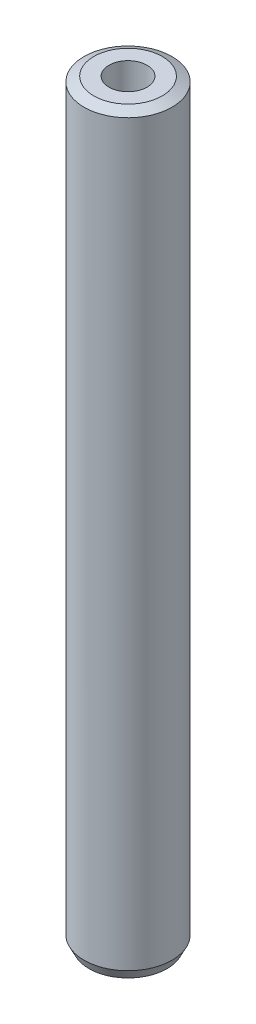
ISO-10303-21;
HEADER;
FILE_DESCRIPTION(('STEP AP214'),'2;1');
FILE_NAME('part.step','',(''),(''),'','','');
FILE_SCHEMA(('AUTOMOTIVE_DESIGN { 1 0 10303 214 1 1 1 1 }'));
ENDSEC;
DATA;
#1=APPLICATION_CONTEXT('core data for automotive mechanical design processes');
#2=APPLICATION_PROTOCOL_DEFINITION('international standard','automotive_design',2000,#1);
#3=PRODUCT_CONTEXT('',#1,'mechanical');
#4=PRODUCT('Part','Part','',(#3));
#5=PRODUCT_RELATED_PRODUCT_CATEGORY('part','',(#4));
#6=PRODUCT_DEFINITION_FORMATION('','',#4);
#7=PRODUCT_DEFINITION_CONTEXT('part definition',#1,'design');
#8=PRODUCT_DEFINITION('design','',#6,#7);
#9=PRODUCT_DEFINITION_SHAPE('','',#8);
#10=(LENGTH_UNIT() NAMED_UNIT(*) SI_UNIT(.MILLI.,.METRE.));
#11=(NAMED_UNIT(*) PLANE_ANGLE_UNIT() SI_UNIT($,.RADIAN.));
#12=(NAMED_UNIT(*) SI_UNIT($,.STERADIAN.) SOLID_ANGLE_UNIT());
#13=UNCERTAINTY_MEASURE_WITH_UNIT(LENGTH_MEASURE(1.E-05),#10,'distance_accuracy_value','');
#14=(GEOMETRIC_REPRESENTATION_CONTEXT(3) GLOBAL_UNCERTAINTY_ASSIGNED_CONTEXT((#13)) GLOBAL_UNIT_ASSIGNED_CONTEXT((#10,
#11,#12)) REPRESENTATION_CONTEXT('',''));
#15=CARTESIAN_POINT('',(0.,0.,0.));
#16=DIRECTION('',(0.,0.,1.));
#17=DIRECTION('',(1.,0.,0.));
#18=AXIS2_PLACEMENT_3D('',#15,#16,#17);
#19=CARTESIAN_POINT('',(0.,85.6602626911975,0.));
#20=DIRECTION('',(0.,-1.,0.));
#21=DIRECTION('',(0.,0.,-1.));
#22=AXIS2_PLACEMENT_3D('',#19,#20,#21);
#23=CYLINDRICAL_SURFACE('',#22,5.);
#24=CARTESIAN_POINT('',(0.,85.1010180606395,0.));
#25=DIRECTION('',(0.,1.,0.));
#26=DIRECTION('',(0.,0.,1.));
#27=AXIS2_PLACEMENT_3D('',#24,#25,#26);
#28=CIRCLE('',#27,5.);
#29=CARTESIAN_POINT('',(0.,85.1010180606395,-5.00000000000001));
#30=VERTEX_POINT('',#29);
#31=EDGE_CURVE('E50',#30,#30,#28,.F.);
#32=ORIENTED_EDGE('',*,*,#31,.T.);
#33=EDGE_LOOP('',(#32));
#34=FACE_BOUND('',#33,.T.);
#35=CARTESIAN_POINT('',(0.,1.11116017954196,0.));
#36=DIRECTION('',(0.,1.,0.));
#37=DIRECTION('',(0.,0.,1.));
#38=AXIS2_PLACEMENT_3D('',#35,#36,#37);
#39=CIRCLE('',#38,5.);
#40=CARTESIAN_POINT('',(0.,1.11116017954196,5.));
#41=VERTEX_POINT('',#40);
#42=EDGE_CURVE('E51',#41,#41,#39,.T.);
#43=ORIENTED_EDGE('',*,*,#42,.T.);
#44=EDGE_LOOP('',(#43));
#45=FACE_BOUND('',#44,.T.);
#46=ADVANCED_FACE('F39',(#34,#45),#23,.T.);
#47=CARTESIAN_POINT('',(0.,85.6602626911975,0.));
#48=DIRECTION('',(0.,1.,0.));
#49=DIRECTION('',(0.,0.,1.));
#50=AXIS2_PLACEMENT_3D('',#47,#48,#49);
#51=PLANE('',#50);
#52=CARTESIAN_POINT('',(0.,85.6602626911975,0.));
#53=DIRECTION('',(0.,1.,0.));
#54=DIRECTION('',(0.,0.,1.));
#55=AXIS2_PLACEMENT_3D('',#52,#53,#54);
#56=CIRCLE('',#55,3.88883982045803);
#57=CARTESIAN_POINT('',(0.,85.6602626911975,-3.88883982045804));
#58=VERTEX_POINT('',#57);
#59=EDGE_CURVE('E54',#58,#58,#56,.T.);
#60=ORIENTED_EDGE('',*,*,#59,.T.);
#61=EDGE_LOOP('',(#60));
#62=FACE_BOUND('',#61,.T.);
#63=CARTESIAN_POINT('',(0.,85.6602626911975,0.));
#64=DIRECTION('',(0.,1.,0.));
#65=DIRECTION('',(0.,0.,1.));
#66=AXIS2_PLACEMENT_3D('',#63,#64,#65);
#67=CIRCLE('',#66,2.16603742396872);
#68=CARTESIAN_POINT('',(0.,85.6602626911975,2.16603742396872));
#69=VERTEX_POINT('',#68);
#70=EDGE_CURVE('E58',#69,#69,#67,.T.);
#71=ORIENTED_EDGE('',*,*,#70,.F.);
#72=EDGE_LOOP('',(#71));
#73=FACE_BOUND('',#72,.T.);
#74=ADVANCED_FACE('F69',(#62,#73),#51,.T.);
#75=CARTESIAN_POINT('',(0.,0.,0.));
#76=DIRECTION('',(0.,1.,0.));
#77=DIRECTION('',(0.,0.,1.));
#78=AXIS2_PLACEMENT_3D('',#75,#76,#77);
#79=PLANE('',#78);
#80=CARTESIAN_POINT('',(0.,0.,0.));
#81=DIRECTION('',(0.,1.,0.));
#82=DIRECTION('',(0.,0.,1.));
#83=AXIS2_PLACEMENT_3D('',#80,#81,#82);
#84=CIRCLE('',#83,4.44075536944196);
#85=CARTESIAN_POINT('',(0.,0.,4.44075536944196));
#86=VERTEX_POINT('',#85);
#87=EDGE_CURVE('E10',#86,#86,#84,.F.);
#88=ORIENTED_EDGE('',*,*,#87,.T.);
#89=EDGE_LOOP('',(#88));
#90=FACE_BOUND('',#89,.T.);
#91=CARTESIAN_POINT('',(0.,0.,0.));
#92=DIRECTION('',(0.,1.,0.));
#93=DIRECTION('',(0.,0.,1.));
#94=AXIS2_PLACEMENT_3D('',#91,#92,#93);
#95=CIRCLE('',#94,2.16603742396872);
#96=CARTESIAN_POINT('',(0.,0.,2.16603742396872));
#97=VERTEX_POINT('',#96);
#98=EDGE_CURVE('E63',#97,#97,#95,.T.);
#99=ORIENTED_EDGE('',*,*,#98,.T.);
#100=EDGE_LOOP('',(#99));
#101=FACE_BOUND('',#100,.T.);
#102=ADVANCED_FACE('F75',(#90,#101),#79,.F.);
#103=CARTESIAN_POINT('',(0.,85.6602626911975,0.));
#104=DIRECTION('',(0.,-1.,0.));
#105=DIRECTION('',(0.,0.,-1.));
#106=AXIS2_PLACEMENT_3D('',#103,#104,#105);
#107=CYLINDRICAL_SURFACE('',#106,2.16603742396872);
#108=ORIENTED_EDGE('',*,*,#70,.T.);
#109=EDGE_LOOP('',(#108));
#110=FACE_BOUND('',#109,.T.);
#111=ORIENTED_EDGE('',*,*,#98,.F.);
#112=EDGE_LOOP('',(#111));
#113=FACE_BOUND('',#112,.T.);
#114=ADVANCED_FACE('F70',(#110,#113),#107,.F.);
#115=CARTESIAN_POINT('',(0.,85.6602626911975,0.));
#116=DIRECTION('',(0.,-1.,0.));
#117=DIRECTION('',(0.,0.,-1.));
#118=AXIS2_PLACEMENT_3D('',#115,#116,#117);
#119=CONICAL_SURFACE('',#118,3.88883982045803,1.10451384690646);
#120=CARTESIAN_POINT('',(0.,85.1010180606395,-5.00000000000001));
#121=CARTESIAN_POINT('',(0.,85.1068435255411,-4.98842541479645));
#122=CARTESIAN_POINT('',(0.,85.1126689904428,-4.97685082959289));
#123=CARTESIAN_POINT('',(0.,85.1243199202461,-4.95370165918577));
#124=CARTESIAN_POINT('',(0.,85.1301453851477,-4.9421270739822));
#125=CARTESIAN_POINT('',(0.,85.141796314951,-4.91897790357508));
#126=CARTESIAN_POINT('',(0.,85.1476217798527,-4.90740331837152));
#127=CARTESIAN_POINT('',(0.,85.159272709656,-4.88425414796439));
#128=CARTESIAN_POINT('',(0.,85.1650981745576,-4.87267956276083));
#129=CARTESIAN_POINT('',(0.,85.1767491043609,-4.84953039235371));
#130=CARTESIAN_POINT('',(0.,85.1825745692625,-4.83795580715014));
#131=CARTESIAN_POINT('',(0.,85.1942254990658,-4.81480663674302));
#132=CARTESIAN_POINT('',(0.,85.2000509639675,-4.80323205153946));
#133=CARTESIAN_POINT('',(0.,85.2117018937708,-4.78008288113233));
#134=CARTESIAN_POINT('',(0.,85.2175273586724,-4.76850829592877));
#135=CARTESIAN_POINT('',(0.,85.2291782884757,-4.74535912552165));
#136=CARTESIAN_POINT('',(0.,85.2350037533774,-4.73378454031808));
#137=CARTESIAN_POINT('',(0.,85.2466546831806,-4.71063536991096));
#138=CARTESIAN_POINT('',(0.,85.2524801480823,-4.6990607847074));
#139=CARTESIAN_POINT('',(0.,85.2641310778856,-4.67591161430027));
#140=CARTESIAN_POINT('',(0.,85.2699565427872,-4.66433702909671));
#141=CARTESIAN_POINT('',(0.,85.2816074725905,-4.64118785868959));
#142=CARTESIAN_POINT('',(0.,85.2874329374922,-4.62961327348602));
#143=CARTESIAN_POINT('',(0.,85.2990838672955,-4.6064641030789));
#144=CARTESIAN_POINT('',(0.,85.3049093321971,-4.59488951787534));
#145=CARTESIAN_POINT('',(0.,85.3165602620004,-4.57174034746821));
#146=CARTESIAN_POINT('',(0.,85.322385726902,-4.56016576226465));
#147=CARTESIAN_POINT('',(0.,85.3340366567053,-4.53701659185753));
#148=CARTESIAN_POINT('',(0.,85.339862121607,-4.52544200665396));
#149=CARTESIAN_POINT('',(0.,85.3515130514103,-4.50229283624684));
#150=CARTESIAN_POINT('',(0.,85.3573385163119,-4.49071825104328));
#151=CARTESIAN_POINT('',(0.,85.3689894461152,-4.46756908063615));
#152=CARTESIAN_POINT('',(0.,85.3748149110169,-4.45599449543259));
#153=CARTESIAN_POINT('',(0.,85.3864658408202,-4.43284532502546));
#154=CARTESIAN_POINT('',(0.,85.3922913057218,-4.4212707398219));
#155=CARTESIAN_POINT('',(0.,85.4039422355251,-4.39812156941478));
#156=CARTESIAN_POINT('',(0.,85.4097677004267,-4.38654698421122));
#157=CARTESIAN_POINT('',(0.,85.42141863023,-4.36339781380409));
#158=CARTESIAN_POINT('',(0.,85.4272440951317,-4.35182322860053));
#159=CARTESIAN_POINT('',(0.,85.438895024935,-4.32867405819341));
#160=CARTESIAN_POINT('',(0.,85.4447204898366,-4.31709947298984));
#161=CARTESIAN_POINT('',(0.,85.4563714196399,-4.29395030258272));
#162=CARTESIAN_POINT('',(0.,85.4621968845416,-4.28237571737916));
#163=CARTESIAN_POINT('',(0.,85.4738478143449,-4.25922654697203));
#164=CARTESIAN_POINT('',(0.,85.4796732792465,-4.24765196176847));
#165=CARTESIAN_POINT('',(0.,85.4913242090498,-4.22450279136134));
#166=CARTESIAN_POINT('',(0.,85.4971496739514,-4.21292820615778));
#167=CARTESIAN_POINT('',(0.,85.5088006037547,-4.18977903575066));
#168=CARTESIAN_POINT('',(0.,85.5146260686564,-4.1782044505471));
#169=CARTESIAN_POINT('',(0.,85.5262769984597,-4.15505528013997));
#170=CARTESIAN_POINT('',(0.,85.5321024633613,-4.14348069493641));
#171=CARTESIAN_POINT('',(0.,85.5437533931646,-4.12033152452928));
#172=CARTESIAN_POINT('',(0.,85.5495788580662,-4.10875693932572));
#173=CARTESIAN_POINT('',(0.,85.5612297878695,-4.0856077689186));
#174=CARTESIAN_POINT('',(0.,85.5670552527712,-4.07403318371504));
#175=CARTESIAN_POINT('',(0.,85.5787061825745,-4.05088401330791));
#176=CARTESIAN_POINT('',(0.,85.5845316474761,-4.03930942810435));
#177=CARTESIAN_POINT('',(0.,85.5961825772794,-4.01616025769722));
#178=CARTESIAN_POINT('',(0.,85.6020080421811,-4.00458567249366));
#179=CARTESIAN_POINT('',(0.,85.6136589719843,-3.98143650208654));
#180=CARTESIAN_POINT('',(0.,85.619484436886,-3.96986191688298));
#181=CARTESIAN_POINT('',(0.,85.6311353666893,-3.94671274647585));
#182=CARTESIAN_POINT('',(0.,85.6369608315909,-3.93513816127229));
#183=CARTESIAN_POINT('',(0.,85.6486117613942,-3.91198899086516));
#184=CARTESIAN_POINT('',(0.,85.6544372262959,-3.9004144056616));
#185=CARTESIAN_POINT('',(0.,85.6602626911975,-3.88883982045804));
#186=B_SPLINE_CURVE_WITH_KNOTS('',3,(#120,#121,#122,#123,#124,#125,#126,#127,#128,#129,#130,
#131,#132,#133,#134,#135,#136,#137,#138,#139,#140,#141,#142,#143,#144,#145,#146,#147,#148,#149,
#150,#151,#152,#153,#154,#155,#156,#157,#158,#159,#160,#161,#162,#163,#164,#165,#166,#167,#168,
#169,#170,#171,#172,#173,#174,#175,#176,#177,#178,#179,#180,#181,#182,#183,#184,#185),
.UNSPECIFIED.,.F.,.F.,(4,2,2,2,2,2,2,2,2,2,2,2,2,2,2,2,2,2,2,2,2,2,2,2,2,2,2,2,2,2,2,2,4),(0.,
0.0388736874452879,0.0777473748905696,0.116621062335852,0.155494749781134,0.194368437226416,
0.233242124671698,0.27211581211698,0.310989499562262,0.349863187007544,0.388736874452826,
0.427610561898108,0.46648424934339,0.505357936788671,0.544231624233954,0.583105311679236,
0.621978999124517,0.660852686569806,0.699726374015088,0.73860006146037,0.777473748905652,
0.816347436350934,0.855221123796216,0.894094811241498,0.93296849868678,0.971842186132062,
1.01071587357734,1.04958956102263,1.08846324846791,1.12733693591319,1.16621062335847,
1.20508431080375,1.24395799824904),.UNSPECIFIED.);
#187=EDGE_CURVE('BSEAM81',#30,#58,#186,.T.);
#188=ORIENTED_EDGE('',*,*,#31,.F.);
#189=ORIENTED_EDGE('',*,*,#59,.F.);
#190=ORIENTED_EDGE('',*,*,#187,.T.);
#191=ORIENTED_EDGE('',*,*,#187,.F.);
#192=EDGE_LOOP('',(#188,#190,#189,#191));
#193=FACE_BOUND('',#192,.T.);
#194=ADVANCED_FACE('F81',(#193),#119,.T.);
#195=CARTESIAN_POINT('',(0.,1.11116017954196,0.));
#196=DIRECTION('',(0.,1.,0.));
#197=DIRECTION('',(0.,0.,1.));
#198=AXIS2_PLACEMENT_3D('',#195,#196,#197);
#199=CONICAL_SURFACE('',#198,5.,0.466282479888444);
#200=ORIENTED_EDGE('',*,*,#87,.F.);
#201=EDGE_LOOP('',(#200));
#202=FACE_BOUND('',#201,.T.);
#203=ORIENTED_EDGE('',*,*,#42,.F.);
#204=EDGE_LOOP('',(#203));
#205=FACE_BOUND('',#204,.T.);
#206=ADVANCED_FACE('F45',(#202,#205),#199,.T.);
#207=CLOSED_SHELL('',(#46,#74,#102,#114,#194,#206));
#208=MANIFOLD_SOLID_BREP('B2',#207);
#209=ADVANCED_BREP_SHAPE_REPRESENTATION('',(#18,#208),#14);
#210=SHAPE_DEFINITION_REPRESENTATION(#9,#209);
ENDSEC;
END-ISO-10303-21;
